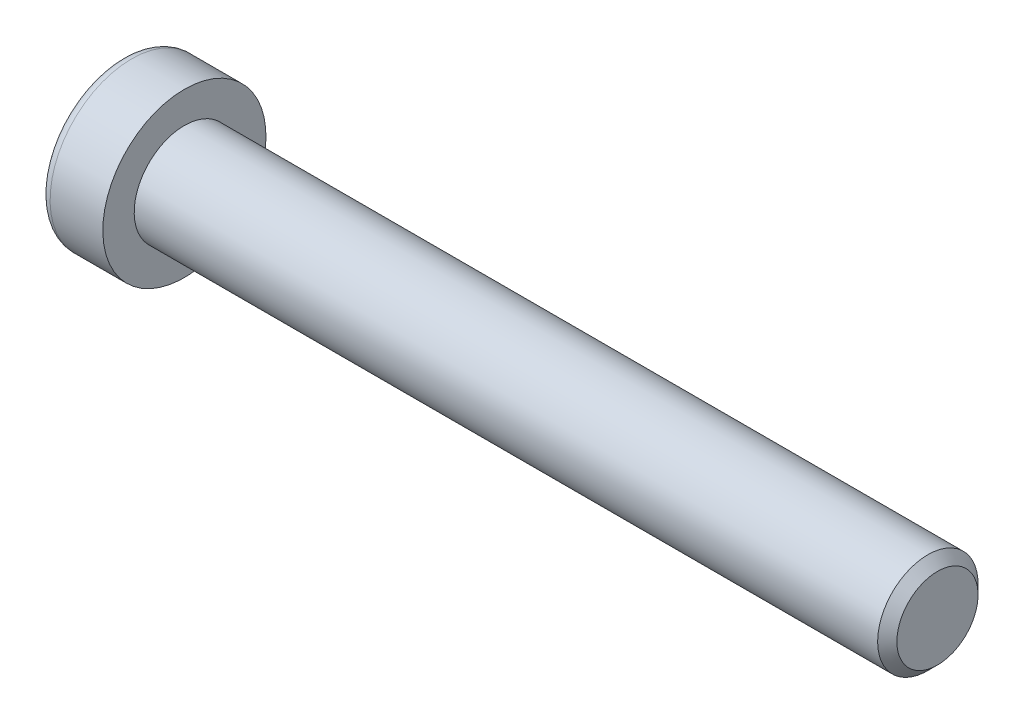
ISO-10303-21;
HEADER;
FILE_DESCRIPTION(('STEP AP214'),'2;1');
FILE_NAME('part.step','',(''),(''),'','','');
FILE_SCHEMA(('AUTOMOTIVE_DESIGN { 1 0 10303 214 1 1 1 1 }'));
ENDSEC;
DATA;
#1=APPLICATION_CONTEXT('core data for automotive mechanical design processes');
#2=APPLICATION_PROTOCOL_DEFINITION('international standard','automotive_design',2000,#1);
#3=PRODUCT_CONTEXT('',#1,'mechanical');
#4=PRODUCT('Part','Part','',(#3));
#5=PRODUCT_RELATED_PRODUCT_CATEGORY('part','',(#4));
#6=PRODUCT_DEFINITION_FORMATION('','',#4);
#7=PRODUCT_DEFINITION_CONTEXT('part definition',#1,'design');
#8=PRODUCT_DEFINITION('design','',#6,#7);
#9=PRODUCT_DEFINITION_SHAPE('','',#8);
#10=(LENGTH_UNIT() NAMED_UNIT(*) SI_UNIT(.MILLI.,.METRE.));
#11=(NAMED_UNIT(*) PLANE_ANGLE_UNIT() SI_UNIT($,.RADIAN.));
#12=(NAMED_UNIT(*) SI_UNIT($,.STERADIAN.) SOLID_ANGLE_UNIT());
#13=UNCERTAINTY_MEASURE_WITH_UNIT(LENGTH_MEASURE(1.E-05),#10,'distance_accuracy_value','');
#14=(GEOMETRIC_REPRESENTATION_CONTEXT(3) GLOBAL_UNCERTAINTY_ASSIGNED_CONTEXT((#13)) GLOBAL_UNIT_ASSIGNED_CONTEXT((#10,
#11,#12)) REPRESENTATION_CONTEXT('',''));
#15=CARTESIAN_POINT('',(0.,0.,0.));
#16=DIRECTION('',(0.,0.,1.));
#17=DIRECTION('',(1.,0.,0.));
#18=AXIS2_PLACEMENT_3D('',#15,#16,#17);
#19=CARTESIAN_POINT('',(-1.21000000177673,0.,0.));
#20=DIRECTION('',(-1.,0.,0.));
#21=DIRECTION('',(0.,0.,1.));
#22=AXIS2_PLACEMENT_3D('',#19,#20,#21);
#23=CONICAL_SURFACE('',#22,2.9040718530382,1.04719754996794);
#24=CARTESIAN_POINT('',(0.466666669012739,-1.13686837721616E-10,0.));
#25=VERTEX_POINT('',#24);
#26=VERTEX_LOOP('',#25);
#27=FACE_BOUND('',#26,.T.);
#28=CARTESIAN_POINT('',(-1.20000000188032,2.50000000042828,1.44337567243126));
#29=CARTESIAN_POINT('',(-1.16336943336427,2.50000000015382,1.31652043353318));
#30=CARTESIAN_POINT('',(-1.13005584831707,2.50000000004123,1.18857018203745));
#31=CARTESIAN_POINT('',(-1.07190798610144,2.49999999995868,0.930454306037677));
#32=CARTESIAN_POINT('',(-1.04709427719735,2.49999999998906,0.800284096806924));
#33=CARTESIAN_POINT('',(-1.00846995036617,2.50000000001067,0.541556812494233));
#34=CARTESIAN_POINT('',(-0.994402236162447,2.50000000000284,0.413039534770439));
#35=CARTESIAN_POINT('',(-0.977611461824864,2.49999999999716,0.155400578562858));
#36=CARTESIAN_POINT('',(-0.974874494142074,2.49999999999929,0.0262798358840899));
#37=CARTESIAN_POINT('',(-0.980582864422355,2.50000000000062,-0.21496841995549));
#38=CARTESIAN_POINT('',(-0.987626608278002,2.50000000000017,-0.327132134383147));
#39=CARTESIAN_POINT('',(-1.00994662771906,2.49999999999983,-0.550728853222557));
#40=CARTESIAN_POINT('',(-1.02523052031715,2.49999999999995,-0.66216108485018));
#41=CARTESIAN_POINT('',(-1.06343729360609,2.50000000000005,-0.886218434015897));
#42=CARTESIAN_POINT('',(-1.08652205474861,2.50000000000003,-0.998815208377872));
#43=CARTESIAN_POINT('',(-1.13891470311393,2.49999999999998,-1.2223298619213));
#44=CARTESIAN_POINT('',(-1.16821028805135,2.49999999999995,-1.33325060237494));
#45=CARTESIAN_POINT('',(-1.20000000215881,2.5,-1.44337567242466));
#46=B_SPLINE_CURVE_WITH_KNOTS('',3,(#28,#29,#30,#31,#32,#33,#34,#35,#36,#37,#38,#39,#40,#41,#42,
#43,#44,#45),.UNSPECIFIED.,.F.,.F.,(4,2,2,2,2,2,2,2,4),(0.,0.396270014515872,0.793492271437725,
1.18088450788727,1.56780111135406,1.90463472821334,2.24178024186127,2.58640202744164,
2.93034746593166),.UNSPECIFIED.);
#47=CARTESIAN_POINT('',(-1.20000000213914,2.49999999973261,1.44337567281968));
#48=VERTEX_POINT('',#47);
#49=CARTESIAN_POINT('',(-1.20000000222827,2.5,-1.44337567266531));
#50=VERTEX_POINT('',#49);
#51=EDGE_CURVE('E19',#48,#50,#46,.T.);
#52=ORIENTED_EDGE('',*,*,#51,.T.);
#53=CARTESIAN_POINT('',(-1.20000000188032,2.49999999974405,-1.44337567361636));
#54=CARTESIAN_POINT('',(-1.16336943336427,2.39014014011794,-1.50680329282772));
#55=CARTESIAN_POINT('',(-1.13005584831707,2.27933197184574,-1.57077841847808));
#56=CARTESIAN_POINT('',(-1.07190798610144,2.05579706606859,-1.69983635640647));
#57=CARTESIAN_POINT('',(-1.04709427719735,1.94306635807401,-1.76492146104816));
#58=CARTESIAN_POINT('',(-1.00846995036617,1.71900195721787,-1.89428510322322));
#59=CARTESIAN_POINT('',(-0.994402236162446,1.60770272987993,-1.95854374207834));
#60=CARTESIAN_POINT('',(-0.977611461824863,1.38458084879682,-2.08736322017721));
#61=CARTESIAN_POINT('',(-0.974874494142074,1.27275900548255,-2.15192359151843));
#62=CARTESIAN_POINT('',(-0.980582864422354,1.06383188730746,-2.27254771943938));
#63=CARTESIAN_POINT('',(-0.987626608278001,0.966695261230055,-2.32862957665281));
#64=CARTESIAN_POINT('',(-1.00994662771905,0.773054822512112,-2.44042793607223));
#65=CARTESIAN_POINT('',(-1.02523052031715,0.676551679122258,-2.49614405188614));
#66=CARTESIAN_POINT('',(-1.06343729360609,0.482512322840195,-2.60817272646909));
#67=CARTESIAN_POINT('',(-1.08652205474861,0.385000655858529,-2.66447111365005));
#68=CARTESIAN_POINT('',(-1.13891470311393,0.191431287771819,-2.77622844042172));
#69=CARTESIAN_POINT('',(-1.16821028805135,0.09537110873237,-2.83168881064853));
#70=CARTESIAN_POINT('',(-1.20000000215881,4.75795613603965E-10,-2.88675134567343));
#71=B_SPLINE_CURVE_WITH_KNOTS('',3,(#53,#54,#55,#56,#57,#58,#59,#60,#61,#62,#63,#64,#65,#66,#67,
#68,#69,#70),.UNSPECIFIED.,.F.,.F.,(4,2,2,2,2,2,2,2,4),(0.,0.396270014515872,0.793492271437724,
1.18088450788727,1.56780111135406,1.90463472821334,2.24178024186127,2.58640202744164,
2.93034746593166),.UNSPECIFIED.);
#72=CARTESIAN_POINT('',(-1.20000000213914,0.,-2.88675134563937));
#73=VERTEX_POINT('',#72);
#74=EDGE_CURVE('E79',#50,#73,#71,.T.);
#75=ORIENTED_EDGE('',*,*,#74,.T.);
#76=CARTESIAN_POINT('',(-1.20000000188032,-6.8421960261224E-10,-2.88675134604762));
#77=CARTESIAN_POINT('',(-1.16336943336427,-0.109859860035873,-2.8233237263609));
#78=CARTESIAN_POINT('',(-1.13005584831707,-0.220668028195489,-2.75934860051552));
#79=CARTESIAN_POINT('',(-1.07190798610144,-0.444202933890087,-2.63029066244415));
#80=CARTESIAN_POINT('',(-1.04709427719735,-0.556933641915047,-2.56520555785509));
#81=CARTESIAN_POINT('',(-1.00846995036617,-0.780998042792801,-2.43584191571745));
#82=CARTESIAN_POINT('',(-0.994402236162447,-0.892297270122914,-2.37158327684878));
#83=CARTESIAN_POINT('',(-0.977611461824864,-1.11541915120034,-2.24276379874007));
#84=CARTESIAN_POINT('',(-0.974874494142073,-1.22724099451673,-2.17820342740253));
#85=CARTESIAN_POINT('',(-0.980582864422354,-1.43616811269316,-2.05757929948389));
#86=CARTESIAN_POINT('',(-0.987626608278001,-1.53330473877011,-2.00149744226967));
#87=CARTESIAN_POINT('',(-1.00994662771906,-1.72694517748772,-1.88969908284967));
#88=CARTESIAN_POINT('',(-1.02523052031715,-1.82344832087769,-1.83398296703597));
#89=CARTESIAN_POINT('',(-1.06343729360609,-2.01748767715985,-1.72195429245319));
#90=CARTESIAN_POINT('',(-1.08652205474861,-2.1149993441415,-1.66565590527218));
#91=CARTESIAN_POINT('',(-1.13891470311393,-2.30856871222816,-1.55389857850043));
#92=CARTESIAN_POINT('',(-1.16821028805135,-2.40462889126758,-1.49843820827358));
#93=CARTESIAN_POINT('',(-1.20000000215881,-2.49999999952421,-1.44337567324877));
#94=B_SPLINE_CURVE_WITH_KNOTS('',3,(#76,#77,#78,#79,#80,#81,#82,#83,#84,#85,#86,#87,#88,#89,#90,
#91,#92,#93),.UNSPECIFIED.,.F.,.F.,(4,2,2,2,2,2,2,2,4),(0.,0.396270014515872,0.793492271437725,
1.18088450788727,1.56780111135406,1.90463472821334,2.24178024186127,2.58640202744164,
2.93034746593167),.UNSPECIFIED.);
#95=CARTESIAN_POINT('',(-1.20000000213914,-2.49999999973261,-1.44337567281968));
#96=VERTEX_POINT('',#95);
#97=EDGE_CURVE('E104',#73,#96,#94,.T.);
#98=ORIENTED_EDGE('',*,*,#97,.T.);
#99=CARTESIAN_POINT('',(-1.20000000188032,-2.50000000042828,-1.44337567243126));
#100=CARTESIAN_POINT('',(-1.16336943336427,-2.50000000015382,-1.31652043353318));
#101=CARTESIAN_POINT('',(-1.13005584831707,-2.50000000004123,-1.18857018203745));
#102=CARTESIAN_POINT('',(-1.07190798610144,-2.49999999995868,-0.93045430603768));
#103=CARTESIAN_POINT('',(-1.04709427719735,-2.49999999998906,-0.800284096806928));
#104=CARTESIAN_POINT('',(-1.00846995036617,-2.50000000001067,-0.541556812494236));
#105=CARTESIAN_POINT('',(-0.994402236162447,-2.50000000000284,-0.413039534770443));
#106=CARTESIAN_POINT('',(-0.977611461824863,-2.49999999999716,-0.155400578562862));
#107=CARTESIAN_POINT('',(-0.974874494142073,-2.49999999999929,-0.0262798358840941));
#108=CARTESIAN_POINT('',(-0.980582864422354,-2.50000000000062,0.214968419955486));
#109=CARTESIAN_POINT('',(-0.987626608278001,-2.50000000000017,0.327132134383144));
#110=CARTESIAN_POINT('',(-1.00994662771905,-2.49999999999983,0.550728853222554));
#111=CARTESIAN_POINT('',(-1.02523052031715,-2.49999999999995,0.662161084850177));
#112=CARTESIAN_POINT('',(-1.06343729360609,-2.50000000000005,0.886218434015895));
#113=CARTESIAN_POINT('',(-1.08652205474861,-2.50000000000002,0.99881520837787));
#114=CARTESIAN_POINT('',(-1.13891470311393,-2.49999999999998,1.2223298619213));
#115=CARTESIAN_POINT('',(-1.16821028805135,-2.49999999999995,1.33325060237494));
#116=CARTESIAN_POINT('',(-1.20000000215881,-2.5,1.44337567242466));
#117=B_SPLINE_CURVE_WITH_KNOTS('',3,(#99,#100,#101,#102,#103,#104,#105,#106,#107,#108,#109,#110,
#111,#112,#113,#114,#115,#116),.UNSPECIFIED.,.F.,.F.,(4,2,2,2,2,2,2,2,4),(0.,0.396270014515872,
0.793492271437724,1.18088450788727,1.56780111135406,1.90463472821334,2.24178024186127,
2.58640202744164,2.93034746593167),.UNSPECIFIED.);
#118=CARTESIAN_POINT('',(-1.20000000213914,-2.49999999973261,1.44337567281969));
#119=VERTEX_POINT('',#118);
#120=EDGE_CURVE('E128',#96,#119,#117,.T.);
#121=ORIENTED_EDGE('',*,*,#120,.T.);
#122=CARTESIAN_POINT('',(-1.20000000188032,-2.49999999974406,1.44337567361636));
#123=CARTESIAN_POINT('',(-1.16336943336427,-2.39014014011795,1.50680329282772));
#124=CARTESIAN_POINT('',(-1.13005584831707,-2.27933197184574,1.57077841847807));
#125=CARTESIAN_POINT('',(-1.07190798610144,-2.05579706606859,1.69983635640647));
#126=CARTESIAN_POINT('',(-1.04709427719735,-1.94306635807401,1.76492146104816));
#127=CARTESIAN_POINT('',(-1.00846995036617,-1.71900195721787,1.89428510322322));
#128=CARTESIAN_POINT('',(-0.994402236162447,-1.60770272987993,1.95854374207834));
#129=CARTESIAN_POINT('',(-0.977611461824864,-1.38458084879682,2.08736322017721));
#130=CARTESIAN_POINT('',(-0.974874494142074,-1.27275900548255,2.15192359151843));
#131=CARTESIAN_POINT('',(-0.980582864422354,-1.06383188730746,2.27254771943938));
#132=CARTESIAN_POINT('',(-0.987626608278001,-0.966695261230056,2.32862957665281));
#133=CARTESIAN_POINT('',(-1.00994662771905,-0.773054822512113,2.44042793607223));
#134=CARTESIAN_POINT('',(-1.02523052031715,-0.676551679122259,2.49614405188614));
#135=CARTESIAN_POINT('',(-1.06343729360609,-0.482512322840196,2.60817272646909));
#136=CARTESIAN_POINT('',(-1.08652205474861,-0.385000655858529,2.66447111365005));
#137=CARTESIAN_POINT('',(-1.13891470311393,-0.19143128777182,2.77622844042172));
#138=CARTESIAN_POINT('',(-1.16821028805135,-0.0953711087323703,2.83168881064852));
#139=CARTESIAN_POINT('',(-1.20000000215881,-4.75795563263291E-10,2.88675134567343));
#140=B_SPLINE_CURVE_WITH_KNOTS('',3,(#122,#123,#124,#125,#126,#127,#128,#129,#130,#131,#132,
#133,#134,#135,#136,#137,#138,#139),.UNSPECIFIED.,.F.,.F.,(4,2,2,2,2,2,2,2,4),(0.,
0.396270014515872,0.793492271437724,1.18088450788727,1.56780111135406,1.90463472821334,
2.24178024186127,2.58640202744164,2.93034746593167),.UNSPECIFIED.);
#141=CARTESIAN_POINT('',(-1.20000000213914,0.,2.88675134563937));
#142=VERTEX_POINT('',#141);
#143=EDGE_CURVE('E136',#119,#142,#140,.T.);
#144=ORIENTED_EDGE('',*,*,#143,.T.);
#145=CARTESIAN_POINT('',(-1.20000000188032,6.84218567980145E-10,2.88675134604763));
#146=CARTESIAN_POINT('',(-1.16336943336427,0.109859860035872,2.8233237263609));
#147=CARTESIAN_POINT('',(-1.13005584831707,0.220668028195487,2.75934860051552));
#148=CARTESIAN_POINT('',(-1.07190798610144,0.444202933890086,2.63029066244415));
#149=CARTESIAN_POINT('',(-1.04709427719735,0.556933641915045,2.56520555785509));
#150=CARTESIAN_POINT('',(-1.00846995036617,0.7809980427928,2.43584191571745));
#151=CARTESIAN_POINT('',(-0.994402236162446,0.892297270122912,2.37158327684878));
#152=CARTESIAN_POINT('',(-0.977611461824863,1.11541915120034,2.24276379874007));
#153=CARTESIAN_POINT('',(-0.974874494142073,1.22724099451673,2.17820342740253));
#154=CARTESIAN_POINT('',(-0.980582864422353,1.43616811269316,2.05757929948389));
#155=CARTESIAN_POINT('',(-0.987626608278,1.53330473877011,2.00149744226967));
#156=CARTESIAN_POINT('',(-1.00994662771905,1.72694517748772,1.88969908284967));
#157=CARTESIAN_POINT('',(-1.02523052031715,1.82344832087769,1.83398296703596));
#158=CARTESIAN_POINT('',(-1.06343729360609,2.01748767715985,1.72195429245319));
#159=CARTESIAN_POINT('',(-1.08652205474861,2.1149993441415,1.66565590527218));
#160=CARTESIAN_POINT('',(-1.13891470311393,2.30856871222816,1.55389857850042));
#161=CARTESIAN_POINT('',(-1.16821028805135,2.40462889126758,1.49843820827358));
#162=CARTESIAN_POINT('',(-1.2000000021588,2.49999999952421,1.44337567324876));
#163=B_SPLINE_CURVE_WITH_KNOTS('',3,(#145,#146,#147,#148,#149,#150,#151,#152,#153,#154,#155,
#156,#157,#158,#159,#160,#161,#162),.UNSPECIFIED.,.F.,.F.,(4,2,2,2,2,2,2,2,4),(0.,
0.396270014515872,0.793492271437725,1.18088450788727,1.56780111135406,1.90463472821334,
2.24178024186127,2.58640202744164,2.93034746593167),.UNSPECIFIED.);
#164=EDGE_CURVE('E81',#142,#48,#163,.T.);
#165=ORIENTED_EDGE('',*,*,#164,.T.);
#166=EDGE_LOOP('',(#52,#75,#98,#121,#144,#165));
#167=FACE_BOUND('',#166,.T.);
#168=ADVANCED_FACE('F15',(#27,#167),#23,.F.);
#169=CARTESIAN_POINT('',(-5.,2.5,1.44337567297406));
#170=DIRECTION('',(0.,1.,0.));
#171=DIRECTION('',(0.,0.,1.));
#172=AXIS2_PLACEMENT_3D('',#169,#170,#171);
#173=PLANE('',#172);
#174=DIRECTION('',(1.,0.,0.));
#175=VECTOR('',#174,1.);
#176=CARTESIAN_POINT('',(-5.,2.5,1.44337567297406));
#177=LINE('',#176,#175);
#178=CARTESIAN_POINT('',(-5.,2.5,1.44337567297406));
#179=VERTEX_POINT('',#178);
#180=EDGE_CURVE('E83',#48,#179,#177,.F.);
#181=ORIENTED_EDGE('',*,*,#180,.T.);
#182=DIRECTION('',(0.,0.,1.));
#183=VECTOR('',#182,1.);
#184=CARTESIAN_POINT('',(-5.,2.5,0.));
#185=LINE('',#184,#183);
#186=CARTESIAN_POINT('',(-5.,2.5,-1.44337567297407));
#187=VERTEX_POINT('',#186);
#188=EDGE_CURVE('E88',#187,#179,#185,.T.);
#189=ORIENTED_EDGE('',*,*,#188,.F.);
#190=DIRECTION('',(1.,0.,0.));
#191=VECTOR('',#190,1.);
#192=CARTESIAN_POINT('',(-5.,2.5,-1.44337567297407));
#193=LINE('',#192,#191);
#194=EDGE_CURVE('E86',#187,#50,#193,.T.);
#195=ORIENTED_EDGE('',*,*,#194,.T.);
#196=ORIENTED_EDGE('',*,*,#51,.F.);
#197=EDGE_LOOP('',(#181,#189,#195,#196));
#198=FACE_BOUND('',#197,.T.);
#199=ADVANCED_FACE('F75',(#198),#173,.F.);
#200=CARTESIAN_POINT('',(-5.,0.,2.88675134594813));
#201=DIRECTION('',(0.,0.500000000000001,0.866025403784438));
#202=DIRECTION('',(0.,-0.866025403784438,0.500000000000001));
#203=AXIS2_PLACEMENT_3D('',#200,#201,#202);
#204=PLANE('',#203);
#205=DIRECTION('',(1.,0.,0.));
#206=VECTOR('',#205,1.);
#207=CARTESIAN_POINT('',(-5.,0.,2.88675134594813));
#208=LINE('',#207,#206);
#209=CARTESIAN_POINT('',(-5.,0.,2.88675134594813));
#210=VERTEX_POINT('',#209);
#211=EDGE_CURVE('E140',#142,#210,#208,.F.);
#212=ORIENTED_EDGE('',*,*,#211,.T.);
#213=DIRECTION('',(0.,-0.866025403784438,0.500000000000001));
#214=VECTOR('',#213,1.);
#215=CARTESIAN_POINT('',(-5.,2.5,1.44337567297406));
#216=LINE('',#215,#214);
#217=EDGE_CURVE('E94',#179,#210,#216,.T.);
#218=ORIENTED_EDGE('',*,*,#217,.F.);
#219=ORIENTED_EDGE('',*,*,#180,.F.);
#220=ORIENTED_EDGE('',*,*,#164,.F.);
#221=EDGE_LOOP('',(#212,#218,#219,#220));
#222=FACE_BOUND('',#221,.T.);
#223=ADVANCED_FACE('F144',(#222),#204,.F.);
#224=CARTESIAN_POINT('',(-5.,-2.5,1.44337567297406));
#225=DIRECTION('',(0.,-0.5,0.866025403784439));
#226=DIRECTION('',(0.,-0.866025403784439,-0.5));
#227=AXIS2_PLACEMENT_3D('',#224,#225,#226);
#228=PLANE('',#227);
#229=DIRECTION('',(1.,0.,0.));
#230=VECTOR('',#229,1.);
#231=CARTESIAN_POINT('',(-5.,-2.5,1.44337567297406));
#232=LINE('',#231,#230);
#233=CARTESIAN_POINT('',(-5.,-2.5,1.44337567297406));
#234=VERTEX_POINT('',#233);
#235=EDGE_CURVE('E135',#119,#234,#232,.F.);
#236=ORIENTED_EDGE('',*,*,#235,.T.);
#237=DIRECTION('',(0.,-0.866025403784439,-0.5));
#238=VECTOR('',#237,1.);
#239=CARTESIAN_POINT('',(-5.,0.,2.88675134594813));
#240=LINE('',#239,#238);
#241=EDGE_CURVE('E223',#210,#234,#240,.T.);
#242=ORIENTED_EDGE('',*,*,#241,.F.);
#243=ORIENTED_EDGE('',*,*,#211,.F.);
#244=ORIENTED_EDGE('',*,*,#143,.F.);
#245=EDGE_LOOP('',(#236,#242,#243,#244));
#246=FACE_BOUND('',#245,.T.);
#247=ADVANCED_FACE('F124',(#246),#228,.F.);
#248=CARTESIAN_POINT('',(-5.,-2.5,-1.44337567297406));
#249=DIRECTION('',(0.,-1.,0.));
#250=DIRECTION('',(0.,0.,-1.));
#251=AXIS2_PLACEMENT_3D('',#248,#249,#250);
#252=PLANE('',#251);
#253=DIRECTION('',(1.,0.,0.));
#254=VECTOR('',#253,1.);
#255=CARTESIAN_POINT('',(-5.,-2.5,-1.44337567297406));
#256=LINE('',#255,#254);
#257=CARTESIAN_POINT('',(-5.,-2.5,-1.44337567297406));
#258=VERTEX_POINT('',#257);
#259=EDGE_CURVE('E134',#96,#258,#256,.F.);
#260=ORIENTED_EDGE('',*,*,#259,.T.);
#261=DIRECTION('',(0.,0.,1.));
#262=VECTOR('',#261,1.);
#263=CARTESIAN_POINT('',(-5.,-2.5,0.));
#264=LINE('',#263,#262);
#265=EDGE_CURVE('E220',#234,#258,#264,.F.);
#266=ORIENTED_EDGE('',*,*,#265,.F.);
#267=ORIENTED_EDGE('',*,*,#235,.F.);
#268=ORIENTED_EDGE('',*,*,#120,.F.);
#269=EDGE_LOOP('',(#260,#266,#267,#268));
#270=FACE_BOUND('',#269,.T.);
#271=ADVANCED_FACE('F120',(#270),#252,.F.);
#272=CARTESIAN_POINT('',(-5.,0.,-2.88675134594813));
#273=DIRECTION('',(0.,-0.5,-0.866025403784439));
#274=DIRECTION('',(0.,0.866025403784439,-0.5));
#275=AXIS2_PLACEMENT_3D('',#272,#273,#274);
#276=PLANE('',#275);
#277=DIRECTION('',(1.,0.,0.));
#278=VECTOR('',#277,1.);
#279=CARTESIAN_POINT('',(-5.,0.,-2.88675134594813));
#280=LINE('',#279,#278);
#281=CARTESIAN_POINT('',(-5.,0.,-2.88675134594813));
#282=VERTEX_POINT('',#281);
#283=EDGE_CURVE('E37',#73,#282,#280,.F.);
#284=ORIENTED_EDGE('',*,*,#283,.T.);
#285=DIRECTION('',(0.,0.866025403784438,-0.500000000000001));
#286=VECTOR('',#285,1.);
#287=CARTESIAN_POINT('',(-5.,-2.5,-1.44337567297406));
#288=LINE('',#287,#286);
#289=EDGE_CURVE('E217',#258,#282,#288,.T.);
#290=ORIENTED_EDGE('',*,*,#289,.F.);
#291=ORIENTED_EDGE('',*,*,#259,.F.);
#292=ORIENTED_EDGE('',*,*,#97,.F.);
#293=EDGE_LOOP('',(#284,#290,#291,#292));
#294=FACE_BOUND('',#293,.T.);
#295=ADVANCED_FACE('F114',(#294),#276,.F.);
#296=CARTESIAN_POINT('',(-5.,2.5,-1.44337567297407));
#297=DIRECTION('',(0.,0.5,-0.866025403784439));
#298=DIRECTION('',(0.,0.866025403784439,0.5));
#299=AXIS2_PLACEMENT_3D('',#296,#297,#298);
#300=PLANE('',#299);
#301=ORIENTED_EDGE('',*,*,#194,.F.);
#302=DIRECTION('',(0.,0.866025403784439,0.5));
#303=VECTOR('',#302,1.);
#304=CARTESIAN_POINT('',(-5.,0.,-2.88675134594813));
#305=LINE('',#304,#303);
#306=EDGE_CURVE('E215',#282,#187,#305,.T.);
#307=ORIENTED_EDGE('',*,*,#306,.F.);
#308=ORIENTED_EDGE('',*,*,#283,.F.);
#309=ORIENTED_EDGE('',*,*,#74,.F.);
#310=EDGE_LOOP('',(#301,#307,#308,#309));
#311=FACE_BOUND('',#310,.T.);
#312=ADVANCED_FACE('F92',(#311),#300,.F.);
#313=CARTESIAN_POINT('',(-5.,4.69337567297407,0.));
#314=DIRECTION('',(-1.,0.,0.));
#315=DIRECTION('',(0.,0.,1.));
#316=AXIS2_PLACEMENT_3D('',#313,#314,#315);
#317=PLANE('',#316);
#318=ORIENTED_EDGE('',*,*,#289,.T.);
#319=ORIENTED_EDGE('',*,*,#306,.T.);
#320=ORIENTED_EDGE('',*,*,#188,.T.);
#321=ORIENTED_EDGE('',*,*,#217,.T.);
#322=ORIENTED_EDGE('',*,*,#241,.T.);
#323=ORIENTED_EDGE('',*,*,#265,.T.);
#324=EDGE_LOOP('',(#318,#319,#320,#321,#322,#323));
#325=FACE_BOUND('',#324,.T.);
#326=CARTESIAN_POINT('',(-5.,0.,0.));
#327=DIRECTION('',(1.,0.,0.));
#328=DIRECTION('',(0.,1.,0.));
#329=AXIS2_PLACEMENT_3D('',#326,#327,#328);
#330=CIRCLE('',#329,5.7);
#331=CARTESIAN_POINT('',(-5.,5.7,0.));
#332=VERTEX_POINT('',#331);
#333=EDGE_CURVE('E192',#332,#332,#330,.T.);
#334=ORIENTED_EDGE('',*,*,#333,.F.);
#335=EDGE_LOOP('',(#334));
#336=FACE_BOUND('',#335,.T.);
#337=ADVANCED_FACE('F113',(#325,#336),#317,.T.);
#338=CARTESIAN_POINT('',(-4.2,0.,0.));
#339=DIRECTION('',(1.,0.,0.));
#340=DIRECTION('',(0.,0.,-1.));
#341=AXIS2_PLACEMENT_3D('',#338,#339,#340);
#342=TOROIDAL_SURFACE('',#341,5.7,0.8);
#343=CARTESIAN_POINT('',(-4.2,0.,0.));
#344=DIRECTION('',(1.,0.,0.));
#345=DIRECTION('',(0.,1.,0.));
#346=AXIS2_PLACEMENT_3D('',#343,#344,#345);
#347=CIRCLE('',#346,6.5);
#348=CARTESIAN_POINT('',(-4.2,6.5,0.));
#349=VERTEX_POINT('',#348);
#350=EDGE_CURVE('E233',#349,#349,#347,.T.);
#351=ORIENTED_EDGE('',*,*,#350,.F.);
#352=EDGE_LOOP('',(#351));
#353=FACE_BOUND('',#352,.T.);
#354=ORIENTED_EDGE('',*,*,#333,.T.);
#355=EDGE_LOOP('',(#354));
#356=FACE_BOUND('',#355,.T.);
#357=ADVANCED_FACE('F176',(#353,#356),#342,.T.);
#358=CARTESIAN_POINT('',(-2.5,0.,0.));
#359=DIRECTION('',(1.,0.,0.));
#360=DIRECTION('',(0.,1.,0.));
#361=AXIS2_PLACEMENT_3D('',#358,#359,#360);
#362=CYLINDRICAL_SURFACE('',#361,6.5);
#363=ORIENTED_EDGE('',*,*,#350,.T.);
#364=EDGE_LOOP('',(#363));
#365=FACE_BOUND('',#364,.T.);
#366=CARTESIAN_POINT('',(0.,0.,0.));
#367=DIRECTION('',(1.,0.,0.));
#368=DIRECTION('',(0.,1.,0.));
#369=AXIS2_PLACEMENT_3D('',#366,#367,#368);
#370=CIRCLE('',#369,6.5);
#371=CARTESIAN_POINT('',(0.,6.5,0.));
#372=VERTEX_POINT('',#371);
#373=EDGE_CURVE('E102',#372,#372,#370,.T.);
#374=ORIENTED_EDGE('',*,*,#373,.F.);
#375=EDGE_LOOP('',(#374));
#376=FACE_BOUND('',#375,.T.);
#377=ADVANCED_FACE('F173',(#365,#376),#362,.T.);
#378=CARTESIAN_POINT('',(60.,2.,0.));
#379=DIRECTION('',(1.,0.,0.));
#380=DIRECTION('',(0.,0.,-1.));
#381=AXIS2_PLACEMENT_3D('',#378,#379,#380);
#382=PLANE('',#381);
#383=CARTESIAN_POINT('',(60.0000000003433,0.,0.));
#384=DIRECTION('',(-1.,0.,0.));
#385=DIRECTION('',(0.,0.,1.));
#386=AXIS2_PLACEMENT_3D('',#383,#384,#385);
#387=CIRCLE('',#386,3.23318750031376);
#388=CARTESIAN_POINT('',(60.0000000003433,0.,3.23318750031376));
#389=VERTEX_POINT('',#388);
#390=EDGE_CURVE('E229',#389,#389,#387,.T.);
#391=ORIENTED_EDGE('',*,*,#390,.F.);
#392=EDGE_LOOP('',(#391));
#393=FACE_BOUND('',#392,.T.);
#394=ADVANCED_FACE('F169',(#393),#382,.T.);
#395=CARTESIAN_POINT('',(0.,5.25,0.));
#396=DIRECTION('',(1.,0.,0.));
#397=DIRECTION('',(0.,0.,-1.));
#398=AXIS2_PLACEMENT_3D('',#395,#396,#397);
#399=PLANE('',#398);
#400=CARTESIAN_POINT('',(0.,0.,0.));
#401=DIRECTION('',(1.,0.,0.));
#402=DIRECTION('',(0.,1.,0.));
#403=AXIS2_PLACEMENT_3D('',#400,#401,#402);
#404=CIRCLE('',#403,4.);
#405=CARTESIAN_POINT('',(0.,4.,0.));
#406=VERTEX_POINT('',#405);
#407=EDGE_CURVE('E28',#406,#406,#404,.T.);
#408=ORIENTED_EDGE('',*,*,#407,.F.);
#409=EDGE_LOOP('',(#408));
#410=FACE_BOUND('',#409,.T.);
#411=ORIENTED_EDGE('',*,*,#373,.T.);
#412=EDGE_LOOP('',(#411));
#413=FACE_BOUND('',#412,.T.);
#414=ADVANCED_FACE('F162',(#410,#413),#399,.T.);
#415=CARTESIAN_POINT('',(59.2331874996717,0.,0.));
#416=DIRECTION('',(-1.,0.,0.));
#417=DIRECTION('',(0.,0.,1.));
#418=AXIS2_PLACEMENT_3D('',#415,#416,#417);
#419=CONICAL_SURFACE('',#418,3.9999999996212,0.785398162507894);
#420=ORIENTED_EDGE('',*,*,#390,.T.);
#421=EDGE_LOOP('',(#420));
#422=FACE_BOUND('',#421,.T.);
#423=CARTESIAN_POINT('',(59.2331875,0.,0.));
#424=DIRECTION('',(1.,0.,0.));
#425=DIRECTION('',(0.,1.,0.));
#426=AXIS2_PLACEMENT_3D('',#423,#424,#425);
#427=CIRCLE('',#426,4.);
#428=CARTESIAN_POINT('',(59.2331875,4.,0.));
#429=VERTEX_POINT('',#428);
#430=EDGE_CURVE('E10',#429,#429,#427,.F.);
#431=ORIENTED_EDGE('',*,*,#430,.F.);
#432=EDGE_LOOP('',(#431));
#433=FACE_BOUND('',#432,.T.);
#434=ADVANCED_FACE('F155',(#422,#433),#419,.T.);
#435=CARTESIAN_POINT('',(49.,0.,0.));
#436=DIRECTION('',(1.,0.,0.));
#437=DIRECTION('',(0.,1.,0.));
#438=AXIS2_PLACEMENT_3D('',#435,#436,#437);
#439=CYLINDRICAL_SURFACE('',#438,4.);
#440=ORIENTED_EDGE('',*,*,#430,.T.);
#441=EDGE_LOOP('',(#440));
#442=FACE_BOUND('',#441,.T.);
#443=ORIENTED_EDGE('',*,*,#407,.T.);
#444=EDGE_LOOP('',(#443));
#445=FACE_BOUND('',#444,.T.);
#446=ADVANCED_FACE('F153',(#442,#445),#439,.T.);
#447=CLOSED_SHELL('',(#168,#199,#223,#247,#271,#295,#312,#337,#357,#377,#394,#414,#434,#446));
#448=MANIFOLD_SOLID_BREP('B1',#447);
#449=ADVANCED_BREP_SHAPE_REPRESENTATION('',(#18,#448),#14);
#450=SHAPE_DEFINITION_REPRESENTATION(#9,#449);
ENDSEC;
END-ISO-10303-21;
